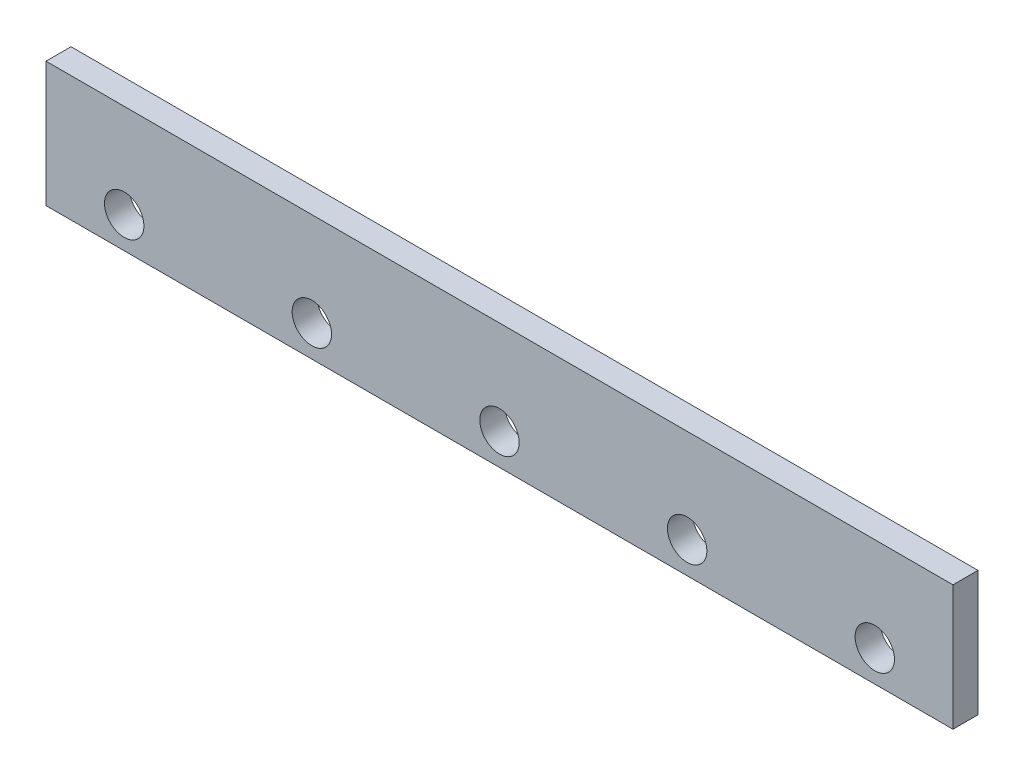
ISO-10303-21;
HEADER;
FILE_DESCRIPTION(('STEP AP214'),'2;1');
FILE_NAME('part.step','',(''),(''),'','','');
FILE_SCHEMA(('AUTOMOTIVE_DESIGN { 1 0 10303 214 1 1 1 1 }'));
ENDSEC;
DATA;
#1=APPLICATION_CONTEXT('core data for automotive mechanical design processes');
#2=APPLICATION_PROTOCOL_DEFINITION('international standard','automotive_design',2000,#1);
#3=PRODUCT_CONTEXT('',#1,'mechanical');
#4=PRODUCT('Part','Part','',(#3));
#5=PRODUCT_RELATED_PRODUCT_CATEGORY('part','',(#4));
#6=PRODUCT_DEFINITION_FORMATION('','',#4);
#7=PRODUCT_DEFINITION_CONTEXT('part definition',#1,'design');
#8=PRODUCT_DEFINITION('design','',#6,#7);
#9=PRODUCT_DEFINITION_SHAPE('','',#8);
#10=(LENGTH_UNIT() NAMED_UNIT(*) SI_UNIT(.MILLI.,.METRE.));
#11=(NAMED_UNIT(*) PLANE_ANGLE_UNIT() SI_UNIT($,.RADIAN.));
#12=(NAMED_UNIT(*) SI_UNIT($,.STERADIAN.) SOLID_ANGLE_UNIT());
#13=UNCERTAINTY_MEASURE_WITH_UNIT(LENGTH_MEASURE(1.E-05),#10,'distance_accuracy_value','');
#14=(GEOMETRIC_REPRESENTATION_CONTEXT(3) GLOBAL_UNCERTAINTY_ASSIGNED_CONTEXT((#13)) GLOBAL_UNIT_ASSIGNED_CONTEXT((#10,
#11,#12)) REPRESENTATION_CONTEXT('',''));
#15=CARTESIAN_POINT('',(0.,0.,0.));
#16=DIRECTION('',(0.,0.,1.));
#17=DIRECTION('',(1.,0.,0.));
#18=AXIS2_PLACEMENT_3D('',#15,#16,#17);
#19=CARTESIAN_POINT('',(0.,0.,16.));
#20=DIRECTION('',(1.,0.,0.));
#21=DIRECTION('',(0.,0.,-1.));
#22=AXIS2_PLACEMENT_3D('',#19,#20,#21);
#23=PLANE('',#22);
#24=DIRECTION('',(0.,-1.,0.));
#25=VECTOR('',#24,1.);
#26=CARTESIAN_POINT('',(0.,0.,0.));
#27=LINE('',#26,#25);
#28=CARTESIAN_POINT('',(0.,80.,0.));
#29=VERTEX_POINT('',#28);
#30=CARTESIAN_POINT('',(0.,0.,0.));
#31=VERTEX_POINT('',#30);
#32=EDGE_CURVE('E96',#29,#31,#27,.T.);
#33=ORIENTED_EDGE('',*,*,#32,.T.);
#34=DIRECTION('',(0.,0.,-1.));
#35=VECTOR('',#34,1.);
#36=CARTESIAN_POINT('',(0.,0.,16.));
#37=LINE('',#36,#35);
#38=CARTESIAN_POINT('',(0.,0.,16.));
#39=VERTEX_POINT('',#38);
#40=EDGE_CURVE('E11',#39,#31,#37,.T.);
#41=ORIENTED_EDGE('',*,*,#40,.F.);
#42=DIRECTION('',(0.,-1.,0.));
#43=VECTOR('',#42,1.);
#44=CARTESIAN_POINT('',(0.,0.,16.));
#45=LINE('',#44,#43);
#46=CARTESIAN_POINT('',(0.,80.,16.));
#47=VERTEX_POINT('',#46);
#48=EDGE_CURVE('E84',#47,#39,#45,.T.);
#49=ORIENTED_EDGE('',*,*,#48,.F.);
#50=DIRECTION('',(0.,0.,-1.));
#51=VECTOR('',#50,1.);
#52=CARTESIAN_POINT('',(0.,80.,16.));
#53=LINE('',#52,#51);
#54=EDGE_CURVE('E92',#47,#29,#53,.T.);
#55=ORIENTED_EDGE('',*,*,#54,.T.);
#56=EDGE_LOOP('',(#33,#41,#49,#55));
#57=FACE_BOUND('',#56,.T.);
#58=ADVANCED_FACE('F33',(#57),#23,.F.);
#59=CARTESIAN_POINT('',(0.,0.,16.));
#60=DIRECTION('',(0.,1.,0.));
#61=DIRECTION('',(0.,0.,1.));
#62=AXIS2_PLACEMENT_3D('',#59,#60,#61);
#63=PLANE('',#62);
#64=DIRECTION('',(1.,0.,0.));
#65=VECTOR('',#64,1.);
#66=CARTESIAN_POINT('',(0.,0.,0.));
#67=LINE('',#66,#65);
#68=CARTESIAN_POINT('',(580.,0.,0.));
#69=VERTEX_POINT('',#68);
#70=EDGE_CURVE('E88',#31,#69,#67,.T.);
#71=ORIENTED_EDGE('',*,*,#70,.T.);
#72=DIRECTION('',(0.,0.,-1.));
#73=VECTOR('',#72,1.);
#74=CARTESIAN_POINT('',(580.,0.,16.));
#75=LINE('',#74,#73);
#76=CARTESIAN_POINT('',(580.,0.,16.));
#77=VERTEX_POINT('',#76);
#78=EDGE_CURVE('E41',#77,#69,#75,.T.);
#79=ORIENTED_EDGE('',*,*,#78,.F.);
#80=DIRECTION('',(1.,0.,0.));
#81=VECTOR('',#80,1.);
#82=CARTESIAN_POINT('',(0.,0.,16.));
#83=LINE('',#82,#81);
#84=EDGE_CURVE('E79',#39,#77,#83,.T.);
#85=ORIENTED_EDGE('',*,*,#84,.F.);
#86=ORIENTED_EDGE('',*,*,#40,.T.);
#87=EDGE_LOOP('',(#71,#79,#85,#86));
#88=FACE_BOUND('',#87,.T.);
#89=ADVANCED_FACE('F87',(#88),#63,.F.);
#90=CARTESIAN_POINT('',(580.,0.,16.));
#91=DIRECTION('',(-1.,0.,0.));
#92=DIRECTION('',(0.,0.,1.));
#93=AXIS2_PLACEMENT_3D('',#90,#91,#92);
#94=PLANE('',#93);
#95=DIRECTION('',(0.,1.,0.));
#96=VECTOR('',#95,1.);
#97=CARTESIAN_POINT('',(580.,0.,0.));
#98=LINE('',#97,#96);
#99=CARTESIAN_POINT('',(580.,80.,0.));
#100=VERTEX_POINT('',#99);
#101=EDGE_CURVE('E66',#69,#100,#98,.T.);
#102=ORIENTED_EDGE('',*,*,#101,.T.);
#103=DIRECTION('',(0.,0.,-1.));
#104=VECTOR('',#103,1.);
#105=CARTESIAN_POINT('',(580.,80.,16.));
#106=LINE('',#105,#104);
#107=CARTESIAN_POINT('',(580.,80.,16.));
#108=VERTEX_POINT('',#107);
#109=EDGE_CURVE('E89',#108,#100,#106,.T.);
#110=ORIENTED_EDGE('',*,*,#109,.F.);
#111=DIRECTION('',(0.,1.,0.));
#112=VECTOR('',#111,1.);
#113=CARTESIAN_POINT('',(580.,0.,16.));
#114=LINE('',#113,#112);
#115=EDGE_CURVE('E82',#77,#108,#114,.T.);
#116=ORIENTED_EDGE('',*,*,#115,.F.);
#117=ORIENTED_EDGE('',*,*,#78,.T.);
#118=EDGE_LOOP('',(#102,#110,#116,#117));
#119=FACE_BOUND('',#118,.T.);
#120=ADVANCED_FACE('F90',(#119),#94,.F.);
#121=CARTESIAN_POINT('',(0.,80.,16.));
#122=DIRECTION('',(0.,-1.,0.));
#123=DIRECTION('',(0.,0.,-1.));
#124=AXIS2_PLACEMENT_3D('',#121,#122,#123);
#125=PLANE('',#124);
#126=DIRECTION('',(-1.,0.,0.));
#127=VECTOR('',#126,1.);
#128=CARTESIAN_POINT('',(0.,80.,0.));
#129=LINE('',#128,#127);
#130=EDGE_CURVE('E72',#100,#29,#129,.T.);
#131=ORIENTED_EDGE('',*,*,#130,.T.);
#132=ORIENTED_EDGE('',*,*,#54,.F.);
#133=DIRECTION('',(-1.,0.,0.));
#134=VECTOR('',#133,1.);
#135=CARTESIAN_POINT('',(0.,80.,16.));
#136=LINE('',#135,#134);
#137=EDGE_CURVE('E49',#108,#47,#136,.T.);
#138=ORIENTED_EDGE('',*,*,#137,.F.);
#139=ORIENTED_EDGE('',*,*,#109,.T.);
#140=EDGE_LOOP('',(#131,#132,#138,#139));
#141=FACE_BOUND('',#140,.T.);
#142=ADVANCED_FACE('F104',(#141),#125,.F.);
#143=CARTESIAN_POINT('',(0.,0.,16.));
#144=DIRECTION('',(0.,0.,-1.));
#145=DIRECTION('',(-1.,0.,0.));
#146=AXIS2_PLACEMENT_3D('',#143,#144,#145);
#147=PLANE('',#146);
#148=CARTESIAN_POINT('',(530.,20.,16.));
#149=DIRECTION('',(0.,0.,1.));
#150=DIRECTION('',(1.,0.,0.));
#151=AXIS2_PLACEMENT_3D('',#148,#149,#150);
#152=CIRCLE('',#151,12.5999999999999);
#153=CARTESIAN_POINT('',(542.6,20.,16.));
#154=VERTEX_POINT('',#153);
#155=EDGE_CURVE('E134',#154,#154,#152,.T.);
#156=ORIENTED_EDGE('',*,*,#155,.F.);
#157=EDGE_LOOP('',(#156));
#158=FACE_BOUND('',#157,.T.);
#159=CARTESIAN_POINT('',(410.,20.,16.));
#160=DIRECTION('',(0.,0.,1.));
#161=DIRECTION('',(1.,0.,0.));
#162=AXIS2_PLACEMENT_3D('',#159,#160,#161);
#163=CIRCLE('',#162,12.5999999999999);
#164=CARTESIAN_POINT('',(422.6,20.,16.));
#165=VERTEX_POINT('',#164);
#166=EDGE_CURVE('E128',#165,#165,#163,.T.);
#167=ORIENTED_EDGE('',*,*,#166,.F.);
#168=EDGE_LOOP('',(#167));
#169=FACE_BOUND('',#168,.T.);
#170=CARTESIAN_POINT('',(290.,20.,16.));
#171=DIRECTION('',(0.,0.,1.));
#172=DIRECTION('',(1.,0.,0.));
#173=AXIS2_PLACEMENT_3D('',#170,#171,#172);
#174=CIRCLE('',#173,12.5999999999999);
#175=CARTESIAN_POINT('',(302.6,20.,16.));
#176=VERTEX_POINT('',#175);
#177=EDGE_CURVE('E122',#176,#176,#174,.T.);
#178=ORIENTED_EDGE('',*,*,#177,.F.);
#179=EDGE_LOOP('',(#178));
#180=FACE_BOUND('',#179,.T.);
#181=CARTESIAN_POINT('',(170.,20.,16.));
#182=DIRECTION('',(0.,0.,1.));
#183=DIRECTION('',(1.,0.,0.));
#184=AXIS2_PLACEMENT_3D('',#181,#182,#183);
#185=CIRCLE('',#184,12.6);
#186=CARTESIAN_POINT('',(182.6,20.,16.));
#187=VERTEX_POINT('',#186);
#188=EDGE_CURVE('E116',#187,#187,#185,.T.);
#189=ORIENTED_EDGE('',*,*,#188,.F.);
#190=EDGE_LOOP('',(#189));
#191=FACE_BOUND('',#190,.T.);
#192=CARTESIAN_POINT('',(50.,20.,16.));
#193=DIRECTION('',(0.,0.,1.));
#194=DIRECTION('',(1.,0.,0.));
#195=AXIS2_PLACEMENT_3D('',#192,#193,#194);
#196=CIRCLE('',#195,12.6);
#197=CARTESIAN_POINT('',(62.6,20.,16.));
#198=VERTEX_POINT('',#197);
#199=EDGE_CURVE('E110',#198,#198,#196,.T.);
#200=ORIENTED_EDGE('',*,*,#199,.F.);
#201=EDGE_LOOP('',(#200));
#202=FACE_BOUND('',#201,.T.);
#203=ORIENTED_EDGE('',*,*,#48,.T.);
#204=ORIENTED_EDGE('',*,*,#84,.T.);
#205=ORIENTED_EDGE('',*,*,#115,.T.);
#206=ORIENTED_EDGE('',*,*,#137,.T.);
#207=EDGE_LOOP('',(#203,#204,#205,#206));
#208=FACE_BOUND('',#207,.T.);
#209=ADVANCED_FACE('F80',(#158,#169,#180,#191,#202,#208),#147,.F.);
#210=CARTESIAN_POINT('',(0.,0.,0.));
#211=DIRECTION('',(0.,0.,-1.));
#212=DIRECTION('',(-1.,0.,0.));
#213=AXIS2_PLACEMENT_3D('',#210,#211,#212);
#214=PLANE('',#213);
#215=CARTESIAN_POINT('',(530.,20.,0.));
#216=DIRECTION('',(0.,0.,1.));
#217=DIRECTION('',(1.,0.,0.));
#218=AXIS2_PLACEMENT_3D('',#215,#216,#217);
#219=CIRCLE('',#218,12.5999999999999);
#220=CARTESIAN_POINT('',(542.6,20.,0.));
#221=VERTEX_POINT('',#220);
#222=EDGE_CURVE('E131',#221,#221,#219,.T.);
#223=ORIENTED_EDGE('',*,*,#222,.T.);
#224=EDGE_LOOP('',(#223));
#225=FACE_BOUND('',#224,.T.);
#226=CARTESIAN_POINT('',(410.,20.,0.));
#227=DIRECTION('',(0.,0.,1.));
#228=DIRECTION('',(1.,0.,0.));
#229=AXIS2_PLACEMENT_3D('',#226,#227,#228);
#230=CIRCLE('',#229,12.5999999999999);
#231=CARTESIAN_POINT('',(422.6,20.,0.));
#232=VERTEX_POINT('',#231);
#233=EDGE_CURVE('E125',#232,#232,#230,.T.);
#234=ORIENTED_EDGE('',*,*,#233,.T.);
#235=EDGE_LOOP('',(#234));
#236=FACE_BOUND('',#235,.T.);
#237=CARTESIAN_POINT('',(290.,20.,0.));
#238=DIRECTION('',(0.,0.,1.));
#239=DIRECTION('',(1.,0.,0.));
#240=AXIS2_PLACEMENT_3D('',#237,#238,#239);
#241=CIRCLE('',#240,12.5999999999999);
#242=CARTESIAN_POINT('',(302.6,20.,0.));
#243=VERTEX_POINT('',#242);
#244=EDGE_CURVE('E119',#243,#243,#241,.T.);
#245=ORIENTED_EDGE('',*,*,#244,.T.);
#246=EDGE_LOOP('',(#245));
#247=FACE_BOUND('',#246,.T.);
#248=CARTESIAN_POINT('',(170.,20.,0.));
#249=DIRECTION('',(0.,0.,1.));
#250=DIRECTION('',(1.,0.,0.));
#251=AXIS2_PLACEMENT_3D('',#248,#249,#250);
#252=CIRCLE('',#251,12.6);
#253=CARTESIAN_POINT('',(182.6,20.,0.));
#254=VERTEX_POINT('',#253);
#255=EDGE_CURVE('E113',#254,#254,#252,.T.);
#256=ORIENTED_EDGE('',*,*,#255,.T.);
#257=EDGE_LOOP('',(#256));
#258=FACE_BOUND('',#257,.T.);
#259=CARTESIAN_POINT('',(50.,20.,0.));
#260=DIRECTION('',(0.,0.,1.));
#261=DIRECTION('',(1.,0.,0.));
#262=AXIS2_PLACEMENT_3D('',#259,#260,#261);
#263=CIRCLE('',#262,12.6);
#264=CARTESIAN_POINT('',(62.6,20.,0.));
#265=VERTEX_POINT('',#264);
#266=EDGE_CURVE('E99',#265,#265,#263,.T.);
#267=ORIENTED_EDGE('',*,*,#266,.T.);
#268=EDGE_LOOP('',(#267));
#269=FACE_BOUND('',#268,.T.);
#270=ORIENTED_EDGE('',*,*,#32,.F.);
#271=ORIENTED_EDGE('',*,*,#130,.F.);
#272=ORIENTED_EDGE('',*,*,#101,.F.);
#273=ORIENTED_EDGE('',*,*,#70,.F.);
#274=EDGE_LOOP('',(#270,#271,#272,#273));
#275=FACE_BOUND('',#274,.T.);
#276=ADVANCED_FACE('F107',(#225,#236,#247,#258,#269,#275),#214,.T.);
#277=CARTESIAN_POINT('',(50.,20.,0.));
#278=DIRECTION('',(0.,0.,1.));
#279=DIRECTION('',(1.,0.,0.));
#280=AXIS2_PLACEMENT_3D('',#277,#278,#279);
#281=CYLINDRICAL_SURFACE('',#280,12.6);
#282=ORIENTED_EDGE('',*,*,#266,.F.);
#283=EDGE_LOOP('',(#282));
#284=FACE_BOUND('',#283,.T.);
#285=ORIENTED_EDGE('',*,*,#199,.T.);
#286=EDGE_LOOP('',(#285));
#287=FACE_BOUND('',#286,.T.);
#288=ADVANCED_FACE('F160',(#284,#287),#281,.F.);
#289=CARTESIAN_POINT('',(170.,20.,0.));
#290=DIRECTION('',(0.,0.,1.));
#291=DIRECTION('',(1.,0.,0.));
#292=AXIS2_PLACEMENT_3D('',#289,#290,#291);
#293=CYLINDRICAL_SURFACE('',#292,12.6);
#294=ORIENTED_EDGE('',*,*,#255,.F.);
#295=EDGE_LOOP('',(#294));
#296=FACE_BOUND('',#295,.T.);
#297=ORIENTED_EDGE('',*,*,#188,.T.);
#298=EDGE_LOOP('',(#297));
#299=FACE_BOUND('',#298,.T.);
#300=ADVANCED_FACE('F162',(#296,#299),#293,.F.);
#301=CARTESIAN_POINT('',(290.,20.,0.));
#302=DIRECTION('',(0.,0.,1.));
#303=DIRECTION('',(1.,0.,0.));
#304=AXIS2_PLACEMENT_3D('',#301,#302,#303);
#305=CYLINDRICAL_SURFACE('',#304,12.5999999999999);
#306=ORIENTED_EDGE('',*,*,#244,.F.);
#307=EDGE_LOOP('',(#306));
#308=FACE_BOUND('',#307,.T.);
#309=ORIENTED_EDGE('',*,*,#177,.T.);
#310=EDGE_LOOP('',(#309));
#311=FACE_BOUND('',#310,.T.);
#312=ADVANCED_FACE('F169',(#308,#311),#305,.F.);
#313=CARTESIAN_POINT('',(410.,20.,0.));
#314=DIRECTION('',(0.,0.,1.));
#315=DIRECTION('',(1.,0.,0.));
#316=AXIS2_PLACEMENT_3D('',#313,#314,#315);
#317=CYLINDRICAL_SURFACE('',#316,12.5999999999999);
#318=ORIENTED_EDGE('',*,*,#233,.F.);
#319=EDGE_LOOP('',(#318));
#320=FACE_BOUND('',#319,.T.);
#321=ORIENTED_EDGE('',*,*,#166,.T.);
#322=EDGE_LOOP('',(#321));
#323=FACE_BOUND('',#322,.T.);
#324=ADVANCED_FACE('F145',(#320,#323),#317,.F.);
#325=CARTESIAN_POINT('',(530.,20.,0.));
#326=DIRECTION('',(0.,0.,1.));
#327=DIRECTION('',(1.,0.,0.));
#328=AXIS2_PLACEMENT_3D('',#325,#326,#327);
#329=CYLINDRICAL_SURFACE('',#328,12.5999999999999);
#330=ORIENTED_EDGE('',*,*,#222,.F.);
#331=EDGE_LOOP('',(#330));
#332=FACE_BOUND('',#331,.T.);
#333=ORIENTED_EDGE('',*,*,#155,.T.);
#334=EDGE_LOOP('',(#333));
#335=FACE_BOUND('',#334,.T.);
#336=ADVANCED_FACE('F142',(#332,#335),#329,.F.);
#337=CLOSED_SHELL('',(#58,#89,#120,#142,#209,#276,#288,#300,#312,#324,#336));
#338=MANIFOLD_SOLID_BREP('B2',#337);
#339=ADVANCED_BREP_SHAPE_REPRESENTATION('',(#18,#338),#14);
#340=SHAPE_DEFINITION_REPRESENTATION(#9,#339);
ENDSEC;
END-ISO-10303-21;
